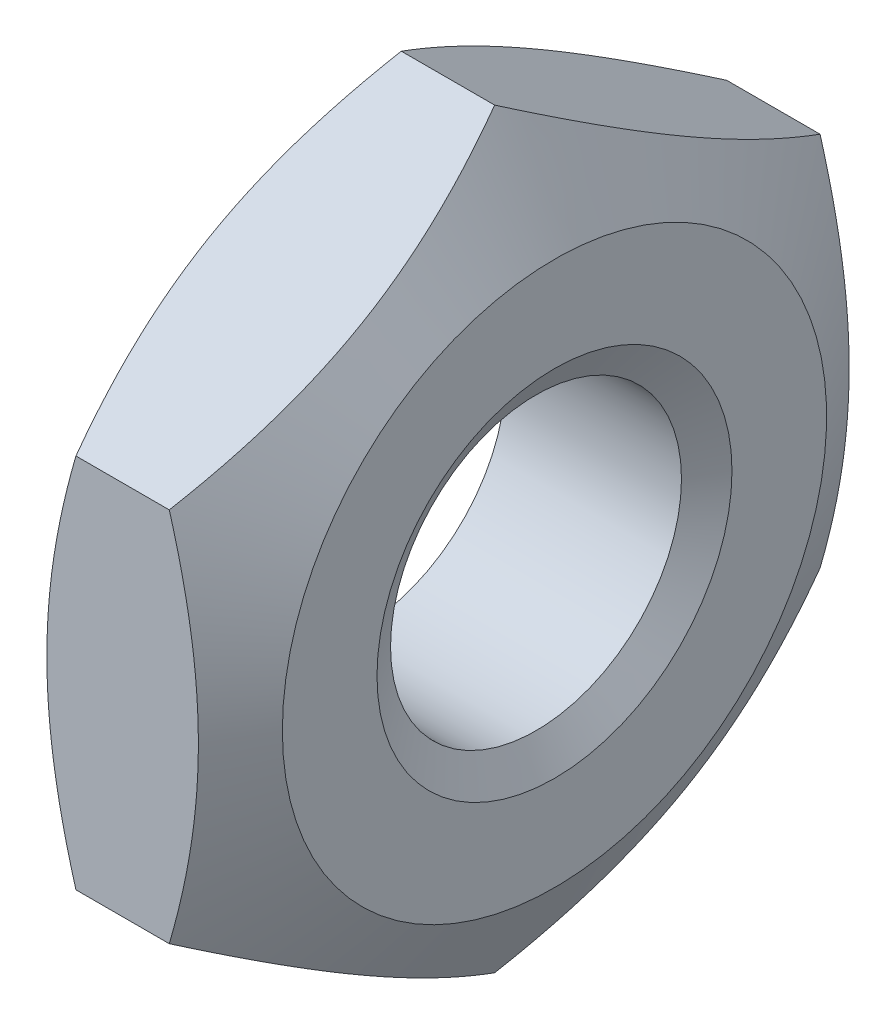
ISO-10303-21;
HEADER;
FILE_DESCRIPTION(('STEP AP214'),'2;1');
FILE_NAME('part.step','',(''),(''),'','','');
FILE_SCHEMA(('AUTOMOTIVE_DESIGN { 1 0 10303 214 1 1 1 1 }'));
ENDSEC;
DATA;
#1=APPLICATION_CONTEXT('core data for automotive mechanical design processes');
#2=APPLICATION_PROTOCOL_DEFINITION('international standard','automotive_design',2000,#1);
#3=PRODUCT_CONTEXT('',#1,'mechanical');
#4=PRODUCT('Part','Part','',(#3));
#5=PRODUCT_RELATED_PRODUCT_CATEGORY('part','',(#4));
#6=PRODUCT_DEFINITION_FORMATION('','',#4);
#7=PRODUCT_DEFINITION_CONTEXT('part definition',#1,'design');
#8=PRODUCT_DEFINITION('design','',#6,#7);
#9=PRODUCT_DEFINITION_SHAPE('','',#8);
#10=(LENGTH_UNIT() NAMED_UNIT(*) SI_UNIT(.MILLI.,.METRE.));
#11=(NAMED_UNIT(*) PLANE_ANGLE_UNIT() SI_UNIT($,.RADIAN.));
#12=(NAMED_UNIT(*) SI_UNIT($,.STERADIAN.) SOLID_ANGLE_UNIT());
#13=UNCERTAINTY_MEASURE_WITH_UNIT(LENGTH_MEASURE(1.E-05),#10,'distance_accuracy_value','');
#14=(GEOMETRIC_REPRESENTATION_CONTEXT(3) GLOBAL_UNCERTAINTY_ASSIGNED_CONTEXT((#13)) GLOBAL_UNIT_ASSIGNED_CONTEXT((#10,
#11,#12)) REPRESENTATION_CONTEXT('',''));
#15=CARTESIAN_POINT('',(0.,0.,0.));
#16=DIRECTION('',(0.,0.,1.));
#17=DIRECTION('',(1.,0.,0.));
#18=AXIS2_PLACEMENT_3D('',#15,#16,#17);
#19=CARTESIAN_POINT('',(0.,-1.58771324027147,2.75));
#20=DIRECTION('',(0.,0.,1.));
#21=DIRECTION('',(1.,0.,0.));
#22=AXIS2_PLACEMENT_3D('',#19,#20,#21);
#23=PLANE('',#22);
#24=CARTESIAN_POINT('',(1.29457225351655,1.58771326701956,2.74999996250818));
#25=CARTESIAN_POINT('',(1.3348658949815,1.44817250543054,2.74999998653462));
#26=CARTESIAN_POINT('',(1.37151084583588,1.30742722769056,2.74999999639105));
#27=CARTESIAN_POINT('',(1.43547350089741,1.0234997600592,2.75000000361762));
#28=CARTESIAN_POINT('',(1.46276858001025,0.880312526966914,2.7500000009577));
#29=CARTESIAN_POINT('',(1.50525533989599,0.595712509213291,2.749999999066));
#30=CARTESIAN_POINT('',(1.52072982655619,0.454343501638864,2.74999999975103));
#31=CARTESIAN_POINT('',(1.53919967953035,0.170940645363721,2.75000000024867));
#32=CARTESIAN_POINT('',(1.54221034414033,0.0289078260481636,2.75000000006236));
#33=CARTESIAN_POINT('',(1.53593113712692,-0.236465250708305,2.74999999994571));
#34=CARTESIAN_POINT('',(1.52818301975736,-0.359845329566622,2.74999999998537));
#35=CARTESIAN_POINT('',(1.50363100109278,-0.605801706342749,2.75000000001465));
#36=CARTESIAN_POINT('',(1.48681872109055,-0.728377154198759,2.75000000000422));
#37=CARTESIAN_POINT('',(1.44479127500911,-0.974840224502085,2.74999999999568));
#38=CARTESIAN_POINT('',(1.41939804044839,-1.09869666945996,2.74999999999784));
#39=CARTESIAN_POINT('',(1.36176613316157,-1.3445627750227,2.75000000000215));
#40=CARTESIAN_POINT('',(1.32954099294126,-1.46657558302494,2.7500000000043));
#41=CARTESIAN_POINT('',(1.29457231078115,-1.58771315367869,2.75));
#42=B_SPLINE_CURVE_WITH_KNOTS('',3,(#24,#25,#26,#27,#28,#29,#30,#31,#32,#33,#34,#35,#36,#37,#38,
#39,#40,#41),.UNSPECIFIED.,.F.,.F.,(4,2,2,2,2,2,2,2,4),(0.,0.435897024607211,0.87284151516214,
1.29897298196378,1.72458125277985,2.09509821025603,2.46595825394133,2.84504219637938,
3.22338215744819),.UNSPECIFIED.);
#43=CARTESIAN_POINT('',(1.29457229828253,1.58771326191962,2.7499999625043));
#44=VERTEX_POINT('',#43);
#45=CARTESIAN_POINT('',(1.29457229828253,-1.58771319697517,2.75));
#46=VERTEX_POINT('',#45);
#47=EDGE_CURVE('E92',#44,#46,#42,.T.);
#48=ORIENTED_EDGE('',*,*,#47,.F.);
#49=DIRECTION('',(1.,0.,0.));
#50=VECTOR('',#49,1.);
#51=CARTESIAN_POINT('',(0.,1.58771324027147,2.75));
#52=LINE('',#51,#50);
#53=CARTESIAN_POINT('',(0.505427701712854,1.58771319697974,2.75));
#54=VERTEX_POINT('',#53);
#55=EDGE_CURVE('E80',#54,#44,#52,.T.);
#56=ORIENTED_EDGE('',*,*,#55,.F.);
#57=CARTESIAN_POINT('',(0.505427689214587,-1.58771315368448,2.75));
#58=CARTESIAN_POINT('',(0.465134065816084,-1.44817239240213,2.75));
#59=CARTESIAN_POINT('',(0.42848912445979,-1.30742711725029,2.75));
#60=CARTESIAN_POINT('',(0.364526480647232,-1.02349965677355,2.75));
#61=CARTESIAN_POINT('',(0.337231403278724,-0.880312428250237,2.75));
#62=CARTESIAN_POINT('',(0.294744648494843,-0.595712418704674,2.75));
#63=CARTESIAN_POINT('',(0.279270165191988,-0.454343414769376,2.75));
#64=CARTESIAN_POINT('',(0.260800317875626,-0.170940566240696,2.75));
#65=CARTESIAN_POINT('',(0.257789655560428,-0.0289077510324584,2.75));
#66=CARTESIAN_POINT('',(0.264068866205861,0.236465315858044,2.75));
#67=CARTESIAN_POINT('',(0.271816984831175,0.359845388978277,2.75));
#68=CARTESIAN_POINT('',(0.296369005019585,0.605801754307572,2.75));
#69=CARTESIAN_POINT('',(0.313181285292067,0.728377196454515,2.75));
#70=CARTESIAN_POINT('',(0.355208730996347,0.97484025488399,2.75));
#71=CARTESIAN_POINT('',(0.380601964862154,1.09869669368433,2.75));
#72=CARTESIAN_POINT('',(0.438233870007022,1.34456278703866,2.75));
#73=CARTESIAN_POINT('',(0.470459008778598,1.46657558899045,2.75));
#74=CARTESIAN_POINT('',(0.505427689215608,1.58771315368801,2.75));
#75=B_SPLINE_CURVE_WITH_KNOTS('',3,(#57,#58,#59,#60,#61,#62,#63,#64,#65,#66,#67,#68,#69,#70,#71,
#72,#73,#74),.UNSPECIFIED.,.F.,.F.,(4,2,2,2,2,2,2,2,4),(0.,0.435897009963347,0.87284148639531,
1.29897294108214,1.72458119955989,2.09509814012618,2.46595816701219,2.84504209096981,
3.22338203342105),.UNSPECIFIED.);
#76=CARTESIAN_POINT('',(0.505427719017693,-1.58771323194447,2.75000001442278));
#77=VERTEX_POINT('',#76);
#78=EDGE_CURVE('E240',#77,#54,#75,.T.);
#79=ORIENTED_EDGE('',*,*,#78,.F.);
#80=DIRECTION('',(1.,0.,0.));
#81=VECTOR('',#80,1.);
#82=CARTESIAN_POINT('',(0.,-1.58771324027147,2.75));
#83=LINE('',#82,#81);
#84=EDGE_CURVE('E95',#46,#77,#83,.F.);
#85=ORIENTED_EDGE('',*,*,#84,.F.);
#86=EDGE_LOOP('',(#48,#56,#79,#85));
#87=FACE_BOUND('',#86,.T.);
#88=ADVANCED_FACE('F17',(#87),#23,.T.);
#89=CARTESIAN_POINT('',(0.,1.58771324027147,2.75));
#90=DIRECTION('',(0.,0.866025403784438,0.5));
#91=DIRECTION('',(0.,-0.5,0.866025403784438));
#92=AXIS2_PLACEMENT_3D('',#89,#90,#91);
#93=PLANE('',#92);
#94=CARTESIAN_POINT('',(1.29457231078985,3.17542643721479,7.50298810942488E-08));
#95=CARTESIAN_POINT('',(1.33486593418973,3.10565605657898,0.120845919165207));
#96=CARTESIAN_POINT('',(1.37151087554543,3.03528341900547,0.242734902909549));
#97=CARTESIAN_POINT('',(1.4354735193551,2.8933196887694,0.488623296513642));
#98=CARTESIAN_POINT('',(1.46276859672133,2.82172607450763,0.612627073911326));
#99=CARTESIAN_POINT('',(1.50525535150132,2.67942606973535,0.859097912093367));
#100=CARTESIAN_POINT('',(1.52072983480255,2.60874156776829,0.981527060808315));
#101=CARTESIAN_POINT('',(1.53919968211584,2.46704014350502,1.22696112713741));
#102=CARTESIAN_POINT('',(1.5422103444296,2.39602373590136,1.34996515327787));
#103=CARTESIAN_POINT('',(1.53593113378199,2.26333720245879,1.57978497068054));
#104=CARTESIAN_POINT('',(1.52818301515616,2.20164716590088,1.68663524831965));
#105=CARTESIAN_POINT('',(1.50363099496757,2.07866898324061,1.89963970890973));
#106=CARTESIAN_POINT('',(1.48681871469543,2.01738126216932,2.00579315568531));
#107=CARTESIAN_POINT('',(1.44479126899262,1.89414973295901,2.21923642537197));
#108=CARTESIAN_POINT('',(1.41939803512797,1.83222151356109,2.32649924779144));
#109=CARTESIAN_POINT('',(1.36176612998602,1.70928846688831,2.53942553055793));
#110=CARTESIAN_POINT('',(1.32954099121619,1.64828206591455,2.6450917166314));
#111=CARTESIAN_POINT('',(1.29457231078115,1.58771328356786,2.74999992500845));
#112=B_SPLINE_CURVE_WITH_KNOTS('',3,(#94,#95,#96,#97,#98,#99,#100,#101,#102,#103,#104,#105,#106,
#107,#108,#109,#110,#111),.UNSPECIFIED.,.F.,.F.,(4,2,2,2,2,2,2,2,4),(0.,0.43589700995994,
0.872841486388193,1.2989729410718,1.72458119954645,2.09509814009978,2.46595816697272,
2.84504209091646,3.22338203335399),.UNSPECIFIED.);
#113=CARTESIAN_POINT('',(1.29457228097853,3.17542648886619,1.441630092163E-08));
#114=VERTEX_POINT('',#113);
#115=EDGE_CURVE('E21',#114,#44,#112,.T.);
#116=ORIENTED_EDGE('',*,*,#115,.F.);
#117=DIRECTION('',(1.,0.,0.));
#118=VECTOR('',#117,1.);
#119=CARTESIAN_POINT('',(0.,3.17542648054294,0.));
#120=LINE('',#119,#118);
#121=CARTESIAN_POINT('',(0.505427701704533,3.17542645888266,3.7516697824523E-08));
#122=VERTEX_POINT('',#121);
#123=EDGE_CURVE('E73',#122,#114,#120,.T.);
#124=ORIENTED_EDGE('',*,*,#123,.F.);
#125=CARTESIAN_POINT('',(0.50542774647871,1.58771319442503,2.75000000443572));
#126=CARTESIAN_POINT('',(0.465134105014867,1.65748359602434,2.62915417204705));
#127=CARTESIAN_POINT('',(0.428489154160352,1.72785624342921,2.50726519098868));
#128=CARTESIAN_POINT('',(0.364526499097539,1.8698199835027,2.2613767947999));
#129=CARTESIAN_POINT('',(0.337231419983547,1.94141359774576,2.13737301211437));
#130=CARTESIAN_POINT('',(0.294744660096045,2.08371360498487,1.89090216587597));
#131=CARTESIAN_POINT('',(0.279270173435209,2.15439810936543,1.76847301435087));
#132=CARTESIAN_POINT('',(0.260800320459957,2.29609953793429,1.52303894155965));
#133=CARTESIAN_POINT('',(0.257789655849517,2.36711594743093,1.40003491176778));
#134=CARTESIAN_POINT('',(0.264068862862295,2.49980248570681,1.17021508576027));
#135=CARTESIAN_POINT('',(0.271816980231374,2.56149252516876,1.06336480317055));
#136=CARTESIAN_POINT('',(0.296368998894718,2.6844707135791,0.850360332679604));
#137=CARTESIAN_POINT('',(0.313181278896204,2.74575843749656,0.744206880953471));
#138=CARTESIAN_POINT('',(0.355208724975951,2.86898997263776,0.530763600977125));
#139=CARTESIAN_POINT('',(0.380601959535718,2.93091819511702,0.423500773224933));
#140=CARTESIAN_POINT('',(0.438233866820531,3.05385124789906,0.210574479885519));
#141=CARTESIAN_POINT('',(0.470459007039793,3.11485765190051,0.104908288572218));
#142=CARTESIAN_POINT('',(0.505427689198827,3.17542643722215,7.50338190788914E-08));
#143=B_SPLINE_CURVE_WITH_KNOTS('',3,(#125,#126,#127,#128,#129,#130,#131,#132,#133,#134,#135,
#136,#137,#138,#139,#140,#141,#142),.UNSPECIFIED.,.F.,.F.,(4,2,2,2,2,2,2,2,4),(0.,
0.435897024608508,0.872841515164909,1.2989729819678,1.72458125278506,2.09509821025188,
2.46595825392783,2.84504219635623,3.22338215741541),.UNSPECIFIED.);
#144=EDGE_CURVE('E83',#54,#122,#143,.T.);
#145=ORIENTED_EDGE('',*,*,#144,.F.);
#146=ORIENTED_EDGE('',*,*,#55,.T.);
#147=EDGE_LOOP('',(#116,#124,#145,#146));
#148=FACE_BOUND('',#147,.T.);
#149=ADVANCED_FACE('F82',(#148),#93,.T.);
#150=CARTESIAN_POINT('',(0.,3.17542648054294,0.));
#151=DIRECTION('',(0.,0.866025403784439,-0.499999999999999));
#152=DIRECTION('',(0.,0.499999999999999,0.866025403784439));
#153=AXIS2_PLACEMENT_3D('',#150,#151,#152);
#154=PLANE('',#153);
#155=CARTESIAN_POINT('',(1.29457225350363,1.58771319441204,-2.75000000440354));
#156=CARTESIAN_POINT('',(1.33486589498799,1.65748359604419,-2.62915417199304));
#157=CARTESIAN_POINT('',(1.3715108458549,1.72785624347397,-2.50726519090587));
#158=CARTESIAN_POINT('',(1.4354735009324,1.86981998359295,-2.26137679464886));
#159=CARTESIAN_POINT('',(1.46276858004835,1.94141359785658,-2.13737301192382));
#160=CARTESIAN_POINT('',(1.50525533992087,2.08371360509855,-1.89090216567771));
#161=CARTESIAN_POINT('',(1.52072982657125,2.15439810946083,-1.76847301418526));
#162=CARTESIAN_POINT('',(1.53919967953318,2.29609953798921,-1.52303894146489));
#163=CARTESIAN_POINT('',(1.54221034414106,2.36711594746364,-1.40003491171122));
#164=CARTESIAN_POINT('',(1.53593113689725,2.49980249053108,-1.17021507740431));
#165=CARTESIAN_POINT('',(1.52818301854473,2.56149253479647,-1.06336478649483));
#166=CARTESIAN_POINT('',(1.5036309965624,2.68447073273384,-0.850360299502648));
#167=CARTESIAN_POINT('',(1.48681871422218,2.74575846137468,-0.74420683959536));
#168=CARTESIAN_POINT('',(1.44479126231129,2.86899000607204,-0.530763543067246));
#169=CARTESIAN_POINT('',(1.41939802421688,2.93091823337939,-0.423500706952565));
#170=CARTESIAN_POINT('',(1.36176610909425,3.05385129564198,-0.210574397192341));
#171=CARTESIAN_POINT('',(1.32954096457649,3.11485770429655,-0.104908197819621));
#172=CARTESIAN_POINT('',(1.29457227789556,3.17542649420606,2.36652109194801E-08));
#173=B_SPLINE_CURVE_WITH_KNOTS('',3,(#155,#156,#157,#158,#159,#160,#161,#162,#163,#164,#165,
#166,#167,#168,#169,#170,#171,#172),.UNSPECIFIED.,.F.,.F.,(4,2,2,2,2,2,2,2,4),(0.,
0.435897024726227,0.872841515414546,1.29897298210153,1.72458125279237,2.09509823912073,
2.46595831176484,2.84504228466597,3.22338227596605),.UNSPECIFIED.);
#174=CARTESIAN_POINT('',(1.29457229828868,1.58771319695387,-2.75));
#175=VERTEX_POINT('',#174);
#176=EDGE_CURVE('E94',#175,#114,#173,.T.);
#177=ORIENTED_EDGE('',*,*,#176,.F.);
#178=DIRECTION('',(1.,0.,0.));
#179=VECTOR('',#178,1.);
#180=CARTESIAN_POINT('',(0.,1.58771324027148,-2.75));
#181=LINE('',#180,#179);
#182=CARTESIAN_POINT('',(0.505427701713243,1.58771326191667,-2.74999996250943));
#183=VERTEX_POINT('',#182);
#184=EDGE_CURVE('E224',#183,#175,#181,.T.);
#185=ORIENTED_EDGE('',*,*,#184,.F.);
#186=CARTESIAN_POINT('',(0.505427746497018,3.17542646143568,4.19351004279331E-08));
#187=CARTESIAN_POINT('',(0.465134105021463,3.10565610146175,-0.120845814484608));
#188=CARTESIAN_POINT('',(0.428489154161905,3.03528347113247,-0.242734805402193));
#189=CARTESIAN_POINT('',(0.364526499095087,2.89331974357748,-0.488623208821343));
#190=CARTESIAN_POINT('',(0.337231419982136,2.82172612472527,-0.612626988847966));
#191=CARTESIAN_POINT('',(0.294744660095458,2.67942611420735,-0.859097833196875));
#192=CARTESIAN_POINT('',(0.279270173434412,2.60874161101299,-0.981526985408165));
#193=CARTESIAN_POINT('',(0.260800320459377,2.46704018330503,-1.22696105869929));
#194=CARTESIAN_POINT('',(0.257789655849371,2.39602377348495,-1.34996508830596));
#195=CARTESIAN_POINT('',(0.264068862863126,2.2633372350044,-1.57978491420127));
#196=CARTESIAN_POINT('',(0.271816980232953,2.20164719560923,-1.686635196834));
#197=CARTESIAN_POINT('',(0.296368998898322,2.07866900724581,-1.89963966736081));
#198=CARTESIAN_POINT('',(0.313181278901083,2.01738128330843,-2.00579311907974));
#199=CARTESIAN_POINT('',(0.355208724983827,1.89414974814857,-2.21923639905424));
#200=CARTESIAN_POINT('',(0.380601959545342,1.83222152567106,-2.32649922681205));
#201=CARTESIAN_POINT('',(0.43823386683394,1.70928847289255,-2.5394255201626));
#202=CARTESIAN_POINT('',(0.470459007055239,1.64828206889286,-2.64509171148143));
#203=CARTESIAN_POINT('',(0.505427689216385,1.58771328356185,-2.74999992501886));
#204=B_SPLINE_CURVE_WITH_KNOTS('',3,(#186,#187,#188,#189,#190,#191,#192,#193,#194,#195,#196,
#197,#198,#199,#200,#201,#202,#203),.UNSPECIFIED.,.F.,.F.,(4,2,2,2,2,2,2,2,4),(0.,
0.435897024613812,0.872841515174975,1.29897298198152,1.72458125280264,2.09509821028114,
2.46595825396867,2.84504219640983,3.22338215748186),.UNSPECIFIED.);
#205=EDGE_CURVE('E162',#122,#183,#204,.T.);
#206=ORIENTED_EDGE('',*,*,#205,.F.);
#207=ORIENTED_EDGE('',*,*,#123,.T.);
#208=EDGE_LOOP('',(#177,#185,#206,#207));
#209=FACE_BOUND('',#208,.T.);
#210=ADVANCED_FACE('F170',(#209),#154,.T.);
#211=CARTESIAN_POINT('',(0.,1.58771324027148,-2.75));
#212=DIRECTION('',(0.,0.,-1.));
#213=DIRECTION('',(0.,1.,0.));
#214=AXIS2_PLACEMENT_3D('',#211,#212,#213);
#215=PLANE('',#214);
#216=CARTESIAN_POINT('',(1.29457225351324,-1.58771326702608,-2.74999996250603));
#217=CARTESIAN_POINT('',(1.33486589497923,-1.44817250543706,-2.74999998653385));
#218=CARTESIAN_POINT('',(1.37151084583416,-1.30742722769695,-2.74999999639085));
#219=CARTESIAN_POINT('',(1.43547350089633,-1.02349976006521,-2.75000000361783));
#220=CARTESIAN_POINT('',(1.46276858000927,-0.880312526972671,-2.75000000095776));
#221=CARTESIAN_POINT('',(1.50525533989531,-0.595712509218577,-2.74999999906595));
#222=CARTESIAN_POINT('',(1.5207298265557,-0.454343501643926,-2.74999999975102));
#223=CARTESIAN_POINT('',(1.5391996795302,-0.170940645368304,-2.75000000024869));
#224=CARTESIAN_POINT('',(1.54221034414031,-0.0289078260524924,-2.75000000006236));
#225=CARTESIAN_POINT('',(1.5359311371272,0.236465250700842,-2.74999999994571));
#226=CARTESIAN_POINT('',(1.52818301975809,0.359845329555778,-2.74999999998537));
#227=CARTESIAN_POINT('',(1.50363100109488,0.605801706325202,-2.75000000001465));
#228=CARTESIAN_POINT('',(1.48681872109357,0.72837715417789,-2.75000000000423));
#229=CARTESIAN_POINT('',(1.44479127501436,0.974840224474515,-2.74999999999568));
#230=CARTESIAN_POINT('',(1.41939804045497,1.09869666942901,-2.74999999999784));
#231=CARTESIAN_POINT('',(1.36176613317106,1.34456277498513,-2.75000000000215));
#232=CARTESIAN_POINT('',(1.32954099295232,1.46657558298412,-2.7500000000043));
#233=CARTESIAN_POINT('',(1.29457231079386,1.58771315363467,-2.75));
#234=B_SPLINE_CURVE_WITH_KNOTS('',3,(#216,#217,#218,#219,#220,#221,#222,#223,#224,#225,#226,
#227,#228,#229,#230,#231,#232,#233),.UNSPECIFIED.,.F.,.F.,(4,2,2,2,2,2,2,2,4),(0.,
0.435897024608011,0.872841515163704,1.29897298196609,1.72458125278292,2.09509821024892,
2.46595825392399,2.84504219635133,3.22338215740953),.UNSPECIFIED.);
#235=CARTESIAN_POINT('',(1.29457229828353,-1.58771326192134,-2.74999996250132));
#236=VERTEX_POINT('',#235);
#237=EDGE_CURVE('E130',#236,#175,#234,.T.);
#238=ORIENTED_EDGE('',*,*,#237,.F.);
#239=DIRECTION('',(1.,0.,0.));
#240=VECTOR('',#239,1.);
#241=CARTESIAN_POINT('',(0.,-1.58771324027146,-2.75000000000001));
#242=LINE('',#241,#240);
#243=CARTESIAN_POINT('',(0.505427701712327,-1.5877131969779,-2.75000000000001));
#244=VERTEX_POINT('',#243);
#245=EDGE_CURVE('E226',#244,#236,#242,.T.);
#246=ORIENTED_EDGE('',*,*,#245,.F.);
#247=CARTESIAN_POINT('',(0.505427746477425,1.5877132670336,-2.74999996251452));
#248=CARTESIAN_POINT('',(0.465134105013983,1.44817250544387,-2.74999998653689));
#249=CARTESIAN_POINT('',(0.428489154159678,1.30742722770352,-2.74999999639166));
#250=CARTESIAN_POINT('',(0.364526499097111,1.0234997600716,-2.75000000361701));
#251=CARTESIAN_POINT('',(0.337231419983156,0.880312526979125,-2.75000000095754));
#252=CARTESIAN_POINT('',(0.294744660095774,0.595712509225043,-2.74999999906616));
#253=CARTESIAN_POINT('',(0.279270173435019,0.45434350165035,-2.74999999975107));
#254=CARTESIAN_POINT('',(0.2608003204599,0.170940645374666,-2.75000000024863));
#255=CARTESIAN_POINT('',(0.257789655849513,0.0289078260588324,-2.75000000006235));
#256=CARTESIAN_POINT('',(0.264068862862481,-0.236465250699283,-2.74999999994573));
#257=CARTESIAN_POINT('',(0.271816980232059,-0.359845329558967,-2.74999999998537));
#258=CARTESIAN_POINT('',(0.296368998897024,-0.605801706337804,-2.75000000001465));
#259=CARTESIAN_POINT('',(0.313181278899633,-0.728377154195156,-2.75000000000423));
#260=CARTESIAN_POINT('',(0.35520872498216,-0.974840224501215,-2.74999999999569));
#261=CARTESIAN_POINT('',(0.3806019595436,-1.09869666946048,-2.74999999999785));
#262=CARTESIAN_POINT('',(0.438233866832112,-1.34456277502587,-2.75000000000216));
#263=CARTESIAN_POINT('',(0.470459007053396,-1.46657558302938,-2.75000000000431));
#264=CARTESIAN_POINT('',(0.505427689214553,-1.58771315368434,-2.75000000000001));
#265=B_SPLINE_CURVE_WITH_KNOTS('',3,(#247,#248,#249,#250,#251,#252,#253,#254,#255,#256,#257,
#258,#259,#260,#261,#262,#263,#264),.UNSPECIFIED.,.F.,.F.,(4,2,2,2,2,2,2,2,4),(0.,
0.435897024608234,0.872841515164381,1.29897298196695,1.72458125278386,2.09509821026411,
2.46595825395353,2.84504219639608,3.22338215746929),.UNSPECIFIED.);
#266=EDGE_CURVE('E153',#183,#244,#265,.T.);
#267=ORIENTED_EDGE('',*,*,#266,.F.);
#268=ORIENTED_EDGE('',*,*,#184,.T.);
#269=EDGE_LOOP('',(#238,#246,#267,#268));
#270=FACE_BOUND('',#269,.T.);
#271=ADVANCED_FACE('F142',(#270),#215,.T.);
#272=CARTESIAN_POINT('',(0.,-1.58771324027146,-2.75000000000001));
#273=DIRECTION('',(0.,-0.866025403784438,-0.500000000000001));
#274=DIRECTION('',(0.,0.500000000000001,-0.866025403784438));
#275=AXIS2_PLACEMENT_3D('',#272,#273,#274);
#276=PLANE('',#275);
#277=CARTESIAN_POINT('',(1.29457225350383,-3.17542646142671,4.19167745286152E-08));
#278=CARTESIAN_POINT('',(1.33486589497758,-3.10565610145225,-0.120845814502055));
#279=CARTESIAN_POINT('',(1.37151084583568,-3.03528347112297,-0.242734805418913));
#280=CARTESIAN_POINT('',(1.43547350090003,-2.89331974356848,-0.488623208836675));
#281=CARTESIAN_POINT('',(1.46276858001197,-2.82172612471676,-0.612626988862636));
#282=CARTESIAN_POINT('',(1.50525533989686,-2.67942611419966,-0.859097833210256));
#283=CARTESIAN_POINT('',(1.52072982655712,-2.60874161100563,-0.981526985420926));
#284=CARTESIAN_POINT('',(1.53919967953091,-2.4670401832984,-1.22696105871076));
#285=CARTESIAN_POINT('',(1.54221034414046,-2.3960237734787,-1.34996508831677));
#286=CARTESIAN_POINT('',(1.53593113712625,-2.26333723499983,-1.5797849142092));
#287=CARTESIAN_POINT('',(1.52818301975651,-2.20164719560593,-1.68663519683971));
#288=CARTESIAN_POINT('',(1.50363100109187,-2.07866900724504,-1.89963966736213));
#289=CARTESIAN_POINT('',(1.48681872108975,-2.01738128330891,-2.0057931190789));
#290=CARTESIAN_POINT('',(1.44479127500876,-1.89414974815162,-2.21923639904895));
#291=CARTESIAN_POINT('',(1.41939804044839,-1.83222152567542,-2.32649922680448));
#292=CARTESIAN_POINT('',(1.36176613316243,-1.70928847289946,-2.53942552015061));
#293=CARTESIAN_POINT('',(1.32954099294263,-1.64828206890102,-2.64509171146729));
#294=CARTESIAN_POINT('',(1.29457231078309,-1.58771328357122,-2.74999992500263));
#295=B_SPLINE_CURVE_WITH_KNOTS('',3,(#277,#278,#279,#280,#281,#282,#283,#284,#285,#286,#287,
#288,#289,#290,#291,#292,#293,#294),.UNSPECIFIED.,.F.,.F.,(4,2,2,2,2,2,2,2,4),(0.,
0.435897024610906,0.872841515169105,1.29897298197331,1.72458125279212,2.09509821026298,
2.46595825394284,2.84504219637561,3.22338215743933),.UNSPECIFIED.);
#296=CARTESIAN_POINT('',(1.29457229828862,-3.17542645888424,3.75139623184387E-08));
#297=VERTEX_POINT('',#296);
#298=EDGE_CURVE('E98',#297,#236,#295,.T.);
#299=ORIENTED_EDGE('',*,*,#298,.F.);
#300=DIRECTION('',(1.,0.,0.));
#301=VECTOR('',#300,1.);
#302=CARTESIAN_POINT('',(0.,-3.17542648054294,0.));
#303=LINE('',#302,#301);
#304=CARTESIAN_POINT('',(0.505427701708526,-3.17542645888958,-3.75047158489996E-08));
#305=VERTEX_POINT('',#304);
#306=EDGE_CURVE('E228',#305,#297,#303,.T.);
#307=ORIENTED_EDGE('',*,*,#306,.F.);
#308=CARTESIAN_POINT('',(0.505427746480459,-1.5877131944223,-2.75000000443815));
#309=CARTESIAN_POINT('',(0.465134105016062,-1.65748359602226,-2.62915417204984));
#310=CARTESIAN_POINT('',(0.428489154161255,-1.72785624342743,-2.50726519099153));
#311=CARTESIAN_POINT('',(0.364526499098095,-1.86981998350123,-2.26137679480266));
#312=CARTESIAN_POINT('',(0.337231419984049,-1.94141359774429,-2.13737301211697));
#313=CARTESIAN_POINT('',(0.294744660096393,-2.08371360498348,-1.89090216587832));
#314=CARTESIAN_POINT('',(0.279270173435457,-2.15439810936411,-1.76847301435313));
#315=CARTESIAN_POINT('',(0.260800320460035,-2.29609953793309,-1.52303894156174));
#316=CARTESIAN_POINT('',(0.257789655849525,-2.36711594742979,-1.40003491176976));
#317=CARTESIAN_POINT('',(0.264068862862244,-2.49980248570692,-1.17021508576008));
#318=CARTESIAN_POINT('',(0.271816980231512,-2.56149252517006,-1.06336480316828));
#319=CARTESIAN_POINT('',(0.296368998895575,-2.68447071358278,-0.850360332673226));
#320=CARTESIAN_POINT('',(0.313181278897592,-2.74575843750142,-0.744206880945054));
#321=CARTESIAN_POINT('',(0.355208724978697,-2.868989972645,-0.530763600964574));
#322=CARTESIAN_POINT('',(0.3806019595393,-2.93091819512548,-0.423500773210288));
#323=CARTESIAN_POINT('',(0.438233866825988,-3.05385124790989,-0.210574479866761));
#324=CARTESIAN_POINT('',(0.470459007046285,-3.11485765191251,-0.10490828855144));
#325=CARTESIAN_POINT('',(0.505427689206416,-3.17542643723529,-7.50110494508272E-08));
#326=B_SPLINE_CURVE_WITH_KNOTS('',3,(#308,#309,#310,#311,#312,#313,#314,#315,#316,#317,#318,
#319,#320,#321,#322,#323,#324,#325),.UNSPECIFIED.,.F.,.F.,(4,2,2,2,2,2,2,2,4),(0.,
0.435897024608982,0.872841515165845,1.29897298196908,1.72458125278668,2.09509821026069,
2.46595825394384,2.84504219637984,3.22338215744656),.UNSPECIFIED.);
#327=EDGE_CURVE('E40',#244,#305,#326,.T.);
#328=ORIENTED_EDGE('',*,*,#327,.F.);
#329=ORIENTED_EDGE('',*,*,#245,.T.);
#330=EDGE_LOOP('',(#299,#307,#328,#329));
#331=FACE_BOUND('',#330,.T.);
#332=ADVANCED_FACE('F139',(#331),#276,.T.);
#333=CARTESIAN_POINT('',(0.,-3.17542648054294,0.));
#334=DIRECTION('',(0.,-0.866025403784439,0.5));
#335=DIRECTION('',(0.,-0.5,-0.866025403784439));
#336=AXIS2_PLACEMENT_3D('',#333,#334,#335);
#337=PLANE('',#336);
#338=CARTESIAN_POINT('',(1.29457225351655,-1.58771319442856,2.75000000441862));
#339=CARTESIAN_POINT('',(1.33486589498149,-1.65748359603057,2.62915417203233));
#340=CARTESIAN_POINT('',(1.37151084583587,-1.72785624343647,2.50726519097504));
#341=CARTESIAN_POINT('',(1.43547350089739,-1.86981998351053,2.26137679478741));
#342=CARTESIAN_POINT('',(1.46276858001024,-1.9414135977531,2.13737301210194));
#343=CARTESIAN_POINT('',(1.50525533989598,-2.08371360499166,1.89090216586395));
#344=CARTESIAN_POINT('',(1.52072982655618,-2.15439810937212,1.7684730143392));
#345=CARTESIAN_POINT('',(1.53919967953035,-2.29609953794068,1.52303894154865));
#346=CARTESIAN_POINT('',(1.54221034414033,-2.36711594743712,1.40003491175708));
#347=CARTESIAN_POINT('',(1.53593113712701,-2.4998024857125,1.1702150857504));
#348=CARTESIAN_POINT('',(1.52818301975782,-2.56149252517417,1.06336480316118));
#349=CARTESIAN_POINT('',(1.50363100109451,-2.68447071358394,0.85036033267123));
#350=CARTESIAN_POINT('',(1.48681872109318,-2.74575843750111,0.74420688094559));
#351=CARTESIAN_POINT('',(1.44479127501397,-2.86898997264172,0.530763600970264));
#352=CARTESIAN_POINT('',(1.41939804045461,-2.93091819512068,0.423500773218597));
#353=CARTESIAN_POINT('',(1.36176613317079,-3.05385124790215,0.210574479880153));
#354=CARTESIAN_POINT('',(1.32954099295211,-3.11485765190335,0.104908288567298));
#355=CARTESIAN_POINT('',(1.29457231079374,-3.17542643722475,7.50293136424143E-08));
#356=B_SPLINE_CURVE_WITH_KNOTS('',3,(#338,#339,#340,#341,#342,#343,#344,#345,#346,#347,#348,
#349,#350,#351,#352,#353,#354,#355),.UNSPECIFIED.,.F.,.F.,(4,2,2,2,2,2,2,2,4),(0.,
0.435897024607167,0.872841515162047,1.29897298196373,1.72458125277985,2.09509821024499,
2.4659582539192,2.84504219634559,3.22338215740283),.UNSPECIFIED.);
#357=EDGE_CURVE('E97',#46,#297,#356,.T.);
#358=ORIENTED_EDGE('',*,*,#357,.F.);
#359=ORIENTED_EDGE('',*,*,#84,.T.);
#360=CARTESIAN_POINT('',(0.505427746483803,-3.17542646143009,-4.19081200904589E-08));
#361=CARTESIAN_POINT('',(0.465134105001863,-3.10565610143288,0.120845814540814));
#362=CARTESIAN_POINT('',(0.428489154135718,-3.0352834710832,0.242734805489202));
#363=CARTESIAN_POINT('',(0.364526499058387,-2.89331974348718,0.488623208976084));
#364=CARTESIAN_POINT('',(0.337231419941837,-2.82172612461432,0.612626989039701));
#365=CARTESIAN_POINT('',(0.294744660068733,-2.67942611409445,0.859097833392851));
#366=CARTESIAN_POINT('',(0.279270173418349,-2.60874161091931,0.981526985570526));
#367=CARTESIAN_POINT('',(0.260800320456498,-2.46704018325347,1.22696105878848));
#368=CARTESIAN_POINT('',(0.257789655848702,-2.39602377345628,1.34996508835558));
#369=CARTESIAN_POINT('',(0.264068863092907,-2.26333723018617,1.57978492254673));
#370=CARTESIAN_POINT('',(0.271816981445826,-2.20164718598886,1.68663521349697));
#371=CARTESIAN_POINT('',(0.296369003429253,-2.07866898810099,1.8996397005206));
#372=CARTESIAN_POINT('',(0.313181285770185,-2.01738125944148,2.00579316041852));
#373=CARTESIAN_POINT('',(0.355208737682777,-1.89414971472808,2.21923645694023));
#374=CARTESIAN_POINT('',(0.380601975778187,-1.83222148742386,2.32649929305814));
#375=CARTESIAN_POINT('',(0.438233890903,-1.70928842516755,2.53942560282471));
#376=CARTESIAN_POINT('',(0.470459035421942,-1.64828201651615,2.64509180220055));
#377=CARTESIAN_POINT('',(0.505427722104101,-1.58771322659866,2.75000002368201));
#378=B_SPLINE_CURVE_WITH_KNOTS('',3,(#360,#361,#362,#363,#364,#365,#366,#367,#368,#369,#370,
#371,#372,#373,#374,#375,#376,#377),.UNSPECIFIED.,.F.,.F.,(4,2,2,2,2,2,2,2,4),(0.,
0.4358970247257,0.872841515413673,1.29897298210015,1.72458125279041,2.09509823912261,
2.46595831177062,2.84504228467598,3.22338227598019),.UNSPECIFIED.);
#379=EDGE_CURVE('E152',#305,#77,#378,.T.);
#380=ORIENTED_EDGE('',*,*,#379,.F.);
#381=ORIENTED_EDGE('',*,*,#306,.T.);
#382=EDGE_LOOP('',(#358,#359,#380,#381));
#383=FACE_BOUND('',#382,.T.);
#384=ADVANCED_FACE('F112',(#383),#337,.T.);
#385=CARTESIAN_POINT('',(1.2915397196025,0.,0.));
#386=DIRECTION('',(-1.,0.,0.));
#387=DIRECTION('',(0.,0.,1.));
#388=AXIS2_PLACEMENT_3D('',#385,#386,#387);
#389=CONICAL_SURFACE('',#388,3.18067903924657,1.04719755119744);
#390=CARTESIAN_POINT('',(1.80000000001814,0.,0.));
#391=DIRECTION('',(-1.,0.,0.));
#392=DIRECTION('',(0.,0.,1.));
#393=AXIS2_PLACEMENT_3D('',#390,#391,#392);
#394=CIRCLE('',#393,2.29999999993424);
#395=CARTESIAN_POINT('',(1.80000000001814,0.,2.29999999993424));
#396=VERTEX_POINT('',#395);
#397=EDGE_CURVE('E214',#396,#396,#394,.F.);
#398=ORIENTED_EDGE('',*,*,#397,.F.);
#399=EDGE_LOOP('',(#398));
#400=FACE_BOUND('',#399,.T.);
#401=ORIENTED_EDGE('',*,*,#237,.T.);
#402=ORIENTED_EDGE('',*,*,#176,.T.);
#403=ORIENTED_EDGE('',*,*,#115,.T.);
#404=ORIENTED_EDGE('',*,*,#47,.T.);
#405=ORIENTED_EDGE('',*,*,#357,.T.);
#406=ORIENTED_EDGE('',*,*,#298,.T.);
#407=EDGE_LOOP('',(#401,#402,#403,#404,#405,#406));
#408=FACE_BOUND('',#407,.T.);
#409=ADVANCED_FACE('F90',(#400,#408),#389,.T.);
#410=CARTESIAN_POINT('',(0.508460280457257,0.,0.));
#411=DIRECTION('',(1.,0.,0.));
#412=DIRECTION('',(0.,0.,-1.));
#413=AXIS2_PLACEMENT_3D('',#410,#411,#412);
#414=CONICAL_SURFACE('',#413,3.18067903936026,1.04719755118995);
#415=CARTESIAN_POINT('',(0.,0.,0.));
#416=DIRECTION('',(1.,0.,0.));
#417=DIRECTION('',(0.,0.,-1.));
#418=AXIS2_PLACEMENT_3D('',#415,#416,#417);
#419=CIRCLE('',#418,2.29999999999109);
#420=CARTESIAN_POINT('',(0.,0.,-2.29999999999109));
#421=VERTEX_POINT('',#420);
#422=EDGE_CURVE('E215',#421,#421,#419,.T.);
#423=ORIENTED_EDGE('',*,*,#422,.T.);
#424=EDGE_LOOP('',(#423));
#425=FACE_BOUND('',#424,.T.);
#426=ORIENTED_EDGE('',*,*,#327,.T.);
#427=ORIENTED_EDGE('',*,*,#379,.T.);
#428=ORIENTED_EDGE('',*,*,#78,.T.);
#429=ORIENTED_EDGE('',*,*,#144,.T.);
#430=ORIENTED_EDGE('',*,*,#205,.T.);
#431=ORIENTED_EDGE('',*,*,#266,.T.);
#432=EDGE_LOOP('',(#426,#427,#428,#429,#430,#431));
#433=FACE_BOUND('',#432,.T.);
#434=ADVANCED_FACE('F111',(#425,#433),#414,.T.);
#435=CARTESIAN_POINT('',(1.8,0.,0.));
#436=DIRECTION('',(1.,0.,0.));
#437=DIRECTION('',(0.,0.,-1.));
#438=AXIS2_PLACEMENT_3D('',#435,#436,#437);
#439=PLANE('',#438);
#440=CARTESIAN_POINT('',(1.79999999993084,0.,0.));
#441=DIRECTION('',(1.,0.,0.));
#442=DIRECTION('',(0.,0.,-1.));
#443=AXIS2_PLACEMENT_3D('',#440,#441,#442);
#444=CIRCLE('',#443,1.50013293870188);
#445=CARTESIAN_POINT('',(1.79999999993084,0.,-1.50013293870188));
#446=VERTEX_POINT('',#445);
#447=EDGE_CURVE('E211',#446,#446,#444,.F.);
#448=ORIENTED_EDGE('',*,*,#447,.T.);
#449=EDGE_LOOP('',(#448));
#450=FACE_BOUND('',#449,.T.);
#451=ORIENTED_EDGE('',*,*,#397,.T.);
#452=EDGE_LOOP('',(#451));
#453=FACE_BOUND('',#452,.T.);
#454=ADVANCED_FACE('F200',(#450,#453),#439,.T.);
#455=CARTESIAN_POINT('',(0.,0.,0.));
#456=DIRECTION('',(1.,0.,0.));
#457=DIRECTION('',(0.,0.,-1.));
#458=AXIS2_PLACEMENT_3D('',#455,#456,#457);
#459=PLANE('',#458);
#460=CARTESIAN_POINT('',(0.,0.,0.));
#461=DIRECTION('',(-1.,0.,0.));
#462=DIRECTION('',(0.,0.,1.));
#463=AXIS2_PLACEMENT_3D('',#460,#461,#462);
#464=CIRCLE('',#463,1.50013293870188);
#465=CARTESIAN_POINT('',(0.,0.,1.50013293870188));
#466=VERTEX_POINT('',#465);
#467=EDGE_CURVE('E220',#466,#466,#464,.F.);
#468=ORIENTED_EDGE('',*,*,#467,.T.);
#469=EDGE_LOOP('',(#468));
#470=FACE_BOUND('',#469,.T.);
#471=ORIENTED_EDGE('',*,*,#422,.F.);
#472=EDGE_LOOP('',(#471));
#473=FACE_BOUND('',#472,.T.);
#474=ADVANCED_FACE('F197',(#470,#473),#459,.F.);
#475=CARTESIAN_POINT('',(1.79999999983238,0.,0.));
#476=DIRECTION('',(1.,0.,0.));
#477=DIRECTION('',(0.,0.,-1.));
#478=AXIS2_PLACEMENT_3D('',#475,#476,#477);
#479=CONICAL_SURFACE('',#478,1.50013293853135,1.04719755126118);
#480=ORIENTED_EDGE('',*,*,#447,.F.);
#481=EDGE_LOOP('',(#480));
#482=FACE_BOUND('',#481,.T.);
#483=CARTESIAN_POINT('',(1.64375,0.,0.));
#484=DIRECTION('',(1.,0.,0.));
#485=DIRECTION('',(0.,0.,-1.));
#486=AXIS2_PLACEMENT_3D('',#483,#484,#485);
#487=CIRCLE('',#486,1.2295);
#488=CARTESIAN_POINT('',(1.64375,0.,-1.2295));
#489=VERTEX_POINT('',#488);
#490=EDGE_CURVE('E31',#489,#489,#487,.F.);
#491=ORIENTED_EDGE('',*,*,#490,.T.);
#492=EDGE_LOOP('',(#491));
#493=FACE_BOUND('',#492,.T.);
#494=ADVANCED_FACE('F189',(#482,#493),#479,.F.);
#495=CARTESIAN_POINT('',(0.,0.,0.));
#496=DIRECTION('',(-1.,0.,0.));
#497=DIRECTION('',(0.,0.,1.));
#498=AXIS2_PLACEMENT_3D('',#495,#496,#497);
#499=CONICAL_SURFACE('',#498,1.50013293870188,1.0471975511946);
#500=ORIENTED_EDGE('',*,*,#467,.F.);
#501=EDGE_LOOP('',(#500));
#502=FACE_BOUND('',#501,.T.);
#503=CARTESIAN_POINT('',(0.15625,0.,0.));
#504=DIRECTION('',(1.,0.,0.));
#505=DIRECTION('',(0.,0.,-1.));
#506=AXIS2_PLACEMENT_3D('',#503,#504,#505);
#507=CIRCLE('',#506,1.2295);
#508=CARTESIAN_POINT('',(0.15625,0.,-1.2295));
#509=VERTEX_POINT('',#508);
#510=EDGE_CURVE('E11',#509,#509,#507,.T.);
#511=ORIENTED_EDGE('',*,*,#510,.T.);
#512=EDGE_LOOP('',(#511));
#513=FACE_BOUND('',#512,.T.);
#514=ADVANCED_FACE('F183',(#502,#513),#499,.F.);
#515=CARTESIAN_POINT('',(-6.79205058954691,0.,0.));
#516=DIRECTION('',(1.,0.,0.));
#517=DIRECTION('',(0.,0.,-1.));
#518=AXIS2_PLACEMENT_3D('',#515,#516,#517);
#519=CYLINDRICAL_SURFACE('',#518,1.2295);
#520=ORIENTED_EDGE('',*,*,#510,.F.);
#521=EDGE_LOOP('',(#520));
#522=FACE_BOUND('',#521,.T.);
#523=ORIENTED_EDGE('',*,*,#490,.F.);
#524=EDGE_LOOP('',(#523));
#525=FACE_BOUND('',#524,.T.);
#526=ADVANCED_FACE('F181',(#522,#525),#519,.F.);
#527=CLOSED_SHELL('',(#88,#149,#210,#271,#332,#384,#409,#434,#454,#474,#494,#514,#526));
#528=MANIFOLD_SOLID_BREP('B1',#527);
#529=ADVANCED_BREP_SHAPE_REPRESENTATION('',(#18,#528),#14);
#530=SHAPE_DEFINITION_REPRESENTATION(#9,#529);
ENDSEC;
END-ISO-10303-21;
